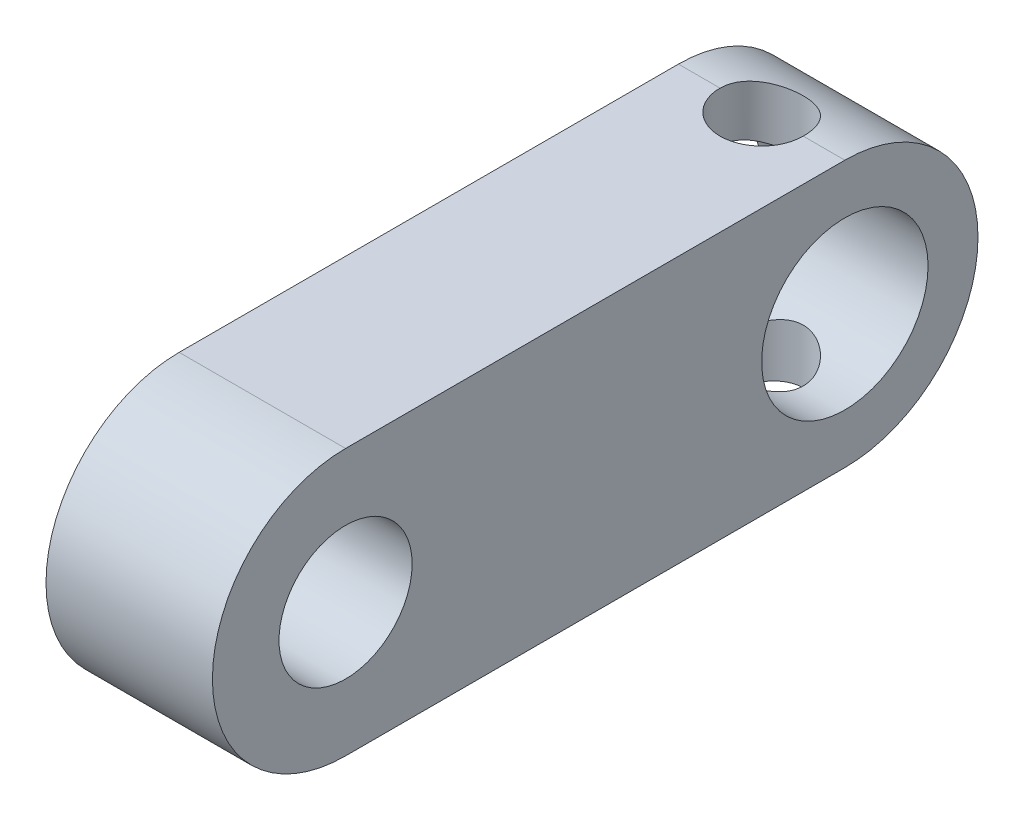
ISO-10303-21;
HEADER;
FILE_DESCRIPTION(('STEP AP214'),'2;1');
FILE_NAME('part.step','',(''),(''),'','','');
FILE_SCHEMA(('AUTOMOTIVE_DESIGN { 1 0 10303 214 1 1 1 1 }'));
ENDSEC;
DATA;
#1=APPLICATION_CONTEXT('core data for automotive mechanical design processes');
#2=APPLICATION_PROTOCOL_DEFINITION('international standard','automotive_design',2000,#1);
#3=PRODUCT_CONTEXT('',#1,'mechanical');
#4=PRODUCT('Part','Part','',(#3));
#5=PRODUCT_RELATED_PRODUCT_CATEGORY('part','',(#4));
#6=PRODUCT_DEFINITION_FORMATION('','',#4);
#7=PRODUCT_DEFINITION_CONTEXT('part definition',#1,'design');
#8=PRODUCT_DEFINITION('design','',#6,#7);
#9=PRODUCT_DEFINITION_SHAPE('','',#8);
#10=(LENGTH_UNIT() NAMED_UNIT(*) SI_UNIT(.MILLI.,.METRE.));
#11=(NAMED_UNIT(*) PLANE_ANGLE_UNIT() SI_UNIT($,.RADIAN.));
#12=(NAMED_UNIT(*) SI_UNIT($,.STERADIAN.) SOLID_ANGLE_UNIT());
#13=UNCERTAINTY_MEASURE_WITH_UNIT(LENGTH_MEASURE(1.E-05),#10,'distance_accuracy_value','');
#14=(GEOMETRIC_REPRESENTATION_CONTEXT(3) GLOBAL_UNCERTAINTY_ASSIGNED_CONTEXT((#13)) GLOBAL_UNIT_ASSIGNED_CONTEXT((#10,
#11,#12)) REPRESENTATION_CONTEXT('',''));
#15=CARTESIAN_POINT('',(0.,0.,0.));
#16=DIRECTION('',(0.,0.,1.));
#17=DIRECTION('',(1.,0.,0.));
#18=AXIS2_PLACEMENT_3D('',#15,#16,#17);
#19=CARTESIAN_POINT('',(10.,0.,15.));
#20=DIRECTION('',(1.,0.,0.));
#21=DIRECTION('',(0.,0.,-1.));
#22=AXIS2_PLACEMENT_3D('',#19,#20,#21);
#23=PLANE('',#22);
#24=CARTESIAN_POINT('',(10.,0.,-15.));
#25=DIRECTION('',(1.,0.,0.));
#26=DIRECTION('',(0.,0.,-1.));
#27=AXIS2_PLACEMENT_3D('',#24,#25,#26);
#28=CIRCLE('',#27,5.);
#29=CARTESIAN_POINT('',(10.,0.,-20.));
#30=VERTEX_POINT('',#29);
#31=EDGE_CURVE('E159',#30,#30,#28,.T.);
#32=ORIENTED_EDGE('',*,*,#31,.F.);
#33=EDGE_LOOP('',(#32));
#34=FACE_BOUND('',#33,.T.);
#35=CARTESIAN_POINT('',(10.,0.,15.));
#36=DIRECTION('',(1.,0.,0.));
#37=DIRECTION('',(0.,0.,-1.));
#38=AXIS2_PLACEMENT_3D('',#35,#36,#37);
#39=CIRCLE('',#38,8.);
#40=CARTESIAN_POINT('',(10.,8.,15.));
#41=VERTEX_POINT('',#40);
#42=CARTESIAN_POINT('',(10.,-8.,15.));
#43=VERTEX_POINT('',#42);
#44=EDGE_CURVE('E163',#41,#43,#39,.T.);
#45=ORIENTED_EDGE('',*,*,#44,.T.);
#46=DIRECTION('',(0.,0.,-1.));
#47=VECTOR('',#46,1.);
#48=CARTESIAN_POINT('',(10.,-8.,15.));
#49=LINE('',#48,#47);
#50=CARTESIAN_POINT('',(10.,-8.,-15.));
#51=VERTEX_POINT('',#50);
#52=EDGE_CURVE('E178',#43,#51,#49,.T.);
#53=ORIENTED_EDGE('',*,*,#52,.T.);
#54=CARTESIAN_POINT('',(10.,0.,-15.));
#55=DIRECTION('',(1.,0.,0.));
#56=DIRECTION('',(0.,0.,1.));
#57=AXIS2_PLACEMENT_3D('',#54,#55,#56);
#58=CIRCLE('',#57,8.);
#59=CARTESIAN_POINT('',(10.,8.,-15.));
#60=VERTEX_POINT('',#59);
#61=EDGE_CURVE('E108',#51,#60,#58,.T.);
#62=ORIENTED_EDGE('',*,*,#61,.T.);
#63=DIRECTION('',(0.,0.,1.));
#64=VECTOR('',#63,1.);
#65=CARTESIAN_POINT('',(10.,8.,-15.));
#66=LINE('',#65,#64);
#67=EDGE_CURVE('E182',#60,#41,#66,.T.);
#68=ORIENTED_EDGE('',*,*,#67,.T.);
#69=EDGE_LOOP('',(#45,#53,#62,#68));
#70=FACE_BOUND('',#69,.T.);
#71=CARTESIAN_POINT('',(10.,0.,15.));
#72=DIRECTION('',(1.,0.,0.));
#73=DIRECTION('',(0.,0.,-1.));
#74=AXIS2_PLACEMENT_3D('',#71,#72,#73);
#75=CIRCLE('',#74,4.);
#76=CARTESIAN_POINT('',(10.,0.,11.));
#77=VERTEX_POINT('',#76);
#78=EDGE_CURVE('E167',#77,#77,#75,.T.);
#79=ORIENTED_EDGE('',*,*,#78,.F.);
#80=EDGE_LOOP('',(#79));
#81=FACE_BOUND('',#80,.T.);
#82=ADVANCED_FACE('F34',(#34,#70,#81),#23,.T.);
#83=CARTESIAN_POINT('',(0.,0.,15.));
#84=DIRECTION('',(1.,0.,0.));
#85=DIRECTION('',(0.,0.,-1.));
#86=AXIS2_PLACEMENT_3D('',#83,#84,#85);
#87=PLANE('',#86);
#88=CARTESIAN_POINT('',(0.,0.,-15.));
#89=DIRECTION('',(1.,0.,0.));
#90=DIRECTION('',(0.,0.,-1.));
#91=AXIS2_PLACEMENT_3D('',#88,#89,#90);
#92=CIRCLE('',#91,5.);
#93=CARTESIAN_POINT('',(0.,0.,-20.));
#94=VERTEX_POINT('',#93);
#95=EDGE_CURVE('E169',#94,#94,#92,.T.);
#96=ORIENTED_EDGE('',*,*,#95,.T.);
#97=EDGE_LOOP('',(#96));
#98=FACE_BOUND('',#97,.T.);
#99=CARTESIAN_POINT('',(0.,0.,15.));
#100=DIRECTION('',(1.,0.,0.));
#101=DIRECTION('',(0.,0.,-1.));
#102=AXIS2_PLACEMENT_3D('',#99,#100,#101);
#103=CIRCLE('',#102,8.);
#104=CARTESIAN_POINT('',(0.,8.,15.));
#105=VERTEX_POINT('',#104);
#106=CARTESIAN_POINT('',(0.,-8.,15.));
#107=VERTEX_POINT('',#106);
#108=EDGE_CURVE('E175',#105,#107,#103,.T.);
#109=ORIENTED_EDGE('',*,*,#108,.F.);
#110=DIRECTION('',(0.,0.,1.));
#111=VECTOR('',#110,1.);
#112=CARTESIAN_POINT('',(0.,8.,-15.));
#113=LINE('',#112,#111);
#114=CARTESIAN_POINT('',(0.,8.,-15.));
#115=VERTEX_POINT('',#114);
#116=EDGE_CURVE('E179',#115,#105,#113,.T.);
#117=ORIENTED_EDGE('',*,*,#116,.F.);
#118=CARTESIAN_POINT('',(0.,0.,-15.));
#119=DIRECTION('',(1.,0.,0.));
#120=DIRECTION('',(0.,0.,1.));
#121=AXIS2_PLACEMENT_3D('',#118,#119,#120);
#122=CIRCLE('',#121,8.);
#123=CARTESIAN_POINT('',(0.,-8.,-15.));
#124=VERTEX_POINT('',#123);
#125=EDGE_CURVE('E189',#124,#115,#122,.T.);
#126=ORIENTED_EDGE('',*,*,#125,.F.);
#127=DIRECTION('',(0.,0.,-1.));
#128=VECTOR('',#127,1.);
#129=CARTESIAN_POINT('',(0.,-8.,15.));
#130=LINE('',#129,#128);
#131=EDGE_CURVE('E187',#107,#124,#130,.T.);
#132=ORIENTED_EDGE('',*,*,#131,.F.);
#133=EDGE_LOOP('',(#109,#117,#126,#132));
#134=FACE_BOUND('',#133,.T.);
#135=CARTESIAN_POINT('',(0.,0.,15.));
#136=DIRECTION('',(1.,0.,0.));
#137=DIRECTION('',(0.,0.,-1.));
#138=AXIS2_PLACEMENT_3D('',#135,#136,#137);
#139=CIRCLE('',#138,4.);
#140=CARTESIAN_POINT('',(0.,0.,11.));
#141=VERTEX_POINT('',#140);
#142=EDGE_CURVE('E95',#141,#141,#139,.T.);
#143=ORIENTED_EDGE('',*,*,#142,.T.);
#144=EDGE_LOOP('',(#143));
#145=FACE_BOUND('',#144,.T.);
#146=ADVANCED_FACE('F148',(#98,#134,#145),#87,.F.);
#147=CARTESIAN_POINT('',(10.,0.,15.));
#148=DIRECTION('',(-1.,0.,0.));
#149=DIRECTION('',(0.,0.,1.));
#150=AXIS2_PLACEMENT_3D('',#147,#148,#149);
#151=CYLINDRICAL_SURFACE('',#150,8.);
#152=ORIENTED_EDGE('',*,*,#108,.T.);
#153=DIRECTION('',(-1.,0.,0.));
#154=VECTOR('',#153,1.);
#155=CARTESIAN_POINT('',(10.,-8.,15.));
#156=LINE('',#155,#154);
#157=EDGE_CURVE('E11',#43,#107,#156,.T.);
#158=ORIENTED_EDGE('',*,*,#157,.F.);
#159=ORIENTED_EDGE('',*,*,#44,.F.);
#160=DIRECTION('',(-1.,0.,0.));
#161=VECTOR('',#160,1.);
#162=CARTESIAN_POINT('',(10.,8.,15.));
#163=LINE('',#162,#161);
#164=EDGE_CURVE('E184',#41,#105,#163,.T.);
#165=ORIENTED_EDGE('',*,*,#164,.T.);
#166=EDGE_LOOP('',(#152,#158,#159,#165));
#167=FACE_BOUND('',#166,.T.);
#168=ADVANCED_FACE('F36',(#167),#151,.T.);
#169=CARTESIAN_POINT('',(10.,-8.,15.));
#170=DIRECTION('',(0.,1.,0.));
#171=DIRECTION('',(0.,0.,1.));
#172=AXIS2_PLACEMENT_3D('',#169,#170,#171);
#173=PLANE('',#172);
#174=DIRECTION('',(-1.,0.,0.));
#175=VECTOR('',#174,1.);
#176=CARTESIAN_POINT('',(10.,-8.,-15.));
#177=LINE('',#176,#175);
#178=CARTESIAN_POINT('',(2.5,-8.,-15.));
#179=VERTEX_POINT('',#178);
#180=EDGE_CURVE('E102',#179,#124,#177,.T.);
#181=ORIENTED_EDGE('',*,*,#180,.F.);
#182=CARTESIAN_POINT('',(5.,-8.,-15.));
#183=DIRECTION('',(0.,1.,0.));
#184=DIRECTION('',(0.,0.,1.));
#185=AXIS2_PLACEMENT_3D('',#182,#183,#184);
#186=CIRCLE('',#185,2.5);
#187=CARTESIAN_POINT('',(7.5,-8.,-15.));
#188=VERTEX_POINT('',#187);
#189=EDGE_CURVE('E54',#179,#188,#186,.T.);
#190=ORIENTED_EDGE('',*,*,#189,.T.);
#191=EDGE_CURVE('E47',#51,#188,#177,.T.);
#192=ORIENTED_EDGE('',*,*,#191,.F.);
#193=ORIENTED_EDGE('',*,*,#52,.F.);
#194=ORIENTED_EDGE('',*,*,#157,.T.);
#195=ORIENTED_EDGE('',*,*,#131,.T.);
#196=EDGE_LOOP('',(#181,#190,#192,#193,#194,#195));
#197=FACE_BOUND('',#196,.T.);
#198=ADVANCED_FACE('F99',(#197),#173,.F.);
#199=CARTESIAN_POINT('',(10.,0.,-15.));
#200=DIRECTION('',(-1.,0.,0.));
#201=DIRECTION('',(0.,0.,1.));
#202=AXIS2_PLACEMENT_3D('',#199,#200,#201);
#203=CYLINDRICAL_SURFACE('',#202,8.);
#204=ORIENTED_EDGE('',*,*,#191,.T.);
#205=CARTESIAN_POINT('',(7.5,-8.,-15.));
#206=CARTESIAN_POINT('',(7.50000852601142,-8.00000828551832,-15.0685487375898));
#207=CARTESIAN_POINT('',(7.49718079886849,-7.9991191440238,-15.1370922432718));
#208=CARTESIAN_POINT('',(7.48591902577332,-7.99560760801551,-15.2736584627093));
#209=CARTESIAN_POINT('',(7.47748615607092,-7.99298557715254,-15.3416812827029));
#210=CARTESIAN_POINT('',(7.45510820487409,-7.98607844882144,-15.4765563962873));
#211=CARTESIAN_POINT('',(7.44117693843174,-7.98179751992037,-15.5434111883322));
#212=CARTESIAN_POINT('',(7.407939330678,-7.97169515696953,-15.6756340975135));
#213=CARTESIAN_POINT('',(7.38863287097266,-7.96587368898799,-15.7410021818694));
#214=CARTESIAN_POINT('',(7.32288580706765,-7.94632105573206,-15.9341595662137));
#215=CARTESIAN_POINT('',(7.26859025811381,-7.93049279279429,-16.05916451445));
#216=CARTESIAN_POINT('',(7.14078064523667,-7.89488403622453,-16.2982595609944));
#217=CARTESIAN_POINT('',(7.06725828053439,-7.87510183643384,-16.4123449158635));
#218=CARTESIAN_POINT('',(6.90069158717582,-7.83300504863903,-16.6299218583453));
#219=CARTESIAN_POINT('',(6.80716348112168,-7.81063554499908,-16.733033083694));
#220=CARTESIAN_POINT('',(6.60426855583545,-7.76620202095558,-16.9223918522217));
#221=CARTESIAN_POINT('',(6.49489797229332,-7.74413807452402,-17.00863537601));
#222=CARTESIAN_POINT('',(6.26010828060366,-7.70222242976765,-17.1638880685593));
#223=CARTESIAN_POINT('',(6.13435936927753,-7.68243887545914,-17.2324186688576));
#224=CARTESIAN_POINT('',(5.87240917132254,-7.64815537243522,-17.3471970391183));
#225=CARTESIAN_POINT('',(5.73621112420153,-7.6336537941174,-17.3934516831105));
#226=CARTESIAN_POINT('',(5.46154529903332,-7.61215225423914,-17.46096881224));
#227=CARTESIAN_POINT('',(5.32326926995984,-7.60493961151812,-17.4829417247826));
#228=CARTESIAN_POINT('',(5.04481675400958,-7.59820109395764,-17.5034911369138));
#229=CARTESIAN_POINT('',(4.9046407403388,-7.59867333904975,-17.5020733589136));
#230=CARTESIAN_POINT('',(4.63225031409493,-7.60706380493777,-17.4764364230841));
#231=CARTESIAN_POINT('',(4.49994023202209,-7.61468692290455,-17.4531208972351));
#232=CARTESIAN_POINT('',(4.24121423761495,-7.63604066973851,-17.3858157557635));
#233=CARTESIAN_POINT('',(4.11479888563526,-7.64977187794002,-17.3418241790561));
#234=CARTESIAN_POINT('',(3.86929545704556,-7.68202096695246,-17.2337772364259));
#235=CARTESIAN_POINT('',(3.75034152089718,-7.70060589200768,-17.1694379491668));
#236=CARTESIAN_POINT('',(3.52462331517965,-7.74043735773378,-17.0227194142873));
#237=CARTESIAN_POINT('',(3.417862092826,-7.76168456099361,-16.9403356719237));
#238=CARTESIAN_POINT('',(3.2144595778417,-7.80562852096723,-16.7554429544294));
#239=CARTESIAN_POINT('',(3.11849843121911,-7.82834727778431,-16.6521896856371));
#240=CARTESIAN_POINT('',(2.94507021527018,-7.87182761918423,-16.4307485553223));
#241=CARTESIAN_POINT('',(2.8676078750545,-7.89258870248028,-16.3125568866703));
#242=CARTESIAN_POINT('',(2.73290548098961,-7.93003694109363,-16.0632627059014));
#243=CARTESIAN_POINT('',(2.67583843937566,-7.94668888732126,-15.9320612621104));
#244=CARTESIAN_POINT('',(2.58485251978712,-7.97377122873637,-15.6613470319037));
#245=CARTESIAN_POINT('',(2.55089970375198,-7.98421074263934,-15.5218467593824));
#246=CARTESIAN_POINT('',(2.51942462400286,-7.9939469560764,-15.317524974591));
#247=CARTESIAN_POINT('',(2.51214152080421,-7.99621235684531,-15.2542135731288));
#248=CARTESIAN_POINT('',(2.50243337115814,-7.99923898062171,-15.1272789183425));
#249=CARTESIAN_POINT('',(2.5000010875289,-8.00000244442139,-15.0636562717724));
#250=CARTESIAN_POINT('',(2.49999999999988,-8.00000000000003,-15.));
#251=B_SPLINE_CURVE_WITH_KNOTS('',3,(#205,#206,#207,#208,#209,#210,#211,#212,#213,#214,#215,
#216,#217,#218,#219,#220,#221,#222,#223,#224,#225,#226,#227,#228,#229,#230,#231,#232,#233,#234,
#235,#236,#237,#238,#239,#240,#241,#242,#243,#244,#245,#246,#247,#248,#249,#250),.UNSPECIFIED.,
.F.,.F.,(4,2,2,2,2,2,2,2,2,2,2,2,2,2,2,2,2,2,2,2,2,2,4),(0.,0.205573209983622,0.411103293652345,
0.616120224939484,0.821141672284254,1.2306957185426,1.64042687401626,2.06149251997578,
2.482658379402,2.91423219989328,3.34567275763257,3.76412558310424,4.18247603777559,
4.58428767511505,4.9861374312315,5.39386205296842,5.80168835169556,6.22804332521313,
6.65450717746368,7.0845073262375,7.51387474652569,7.70501154874773,7.89586297038675),.UNSPECIFIED.);
#252=EDGE_CURVE('E90',#188,#179,#251,.T.);
#253=ORIENTED_EDGE('',*,*,#252,.T.);
#254=ORIENTED_EDGE('',*,*,#180,.T.);
#255=ORIENTED_EDGE('',*,*,#125,.T.);
#256=DIRECTION('',(-1.,0.,0.));
#257=VECTOR('',#256,1.);
#258=CARTESIAN_POINT('',(10.,8.,-15.));
#259=LINE('',#258,#257);
#260=CARTESIAN_POINT('',(2.5,8.,-15.));
#261=VERTEX_POINT('',#260);
#262=EDGE_CURVE('E193',#261,#115,#259,.T.);
#263=ORIENTED_EDGE('',*,*,#262,.F.);
#264=CARTESIAN_POINT('',(2.5,8.,-15.));
#265=CARTESIAN_POINT('',(2.49999147398858,8.00000828551833,-15.0685487375898));
#266=CARTESIAN_POINT('',(2.50281920113152,7.9991191440238,-15.1370922432718));
#267=CARTESIAN_POINT('',(2.51408097422669,7.99560760801552,-15.2736584627093));
#268=CARTESIAN_POINT('',(2.52251384392909,7.99298557715255,-15.3416812827029));
#269=CARTESIAN_POINT('',(2.54489179512592,7.98607844882145,-15.4765563962873));
#270=CARTESIAN_POINT('',(2.55882306156826,7.98179751992038,-15.5434111883322));
#271=CARTESIAN_POINT('',(2.59206066932201,7.97169515696954,-15.6756340975135));
#272=CARTESIAN_POINT('',(2.61136712902735,7.965873688988,-15.7410021818694));
#273=CARTESIAN_POINT('',(2.67711419293235,7.94632105573207,-15.9341595662137));
#274=CARTESIAN_POINT('',(2.7314097418862,7.9304927927943,-16.05916451445));
#275=CARTESIAN_POINT('',(2.85921935476334,7.89488403622453,-16.2982595609944));
#276=CARTESIAN_POINT('',(2.93274171946562,7.87510183643385,-16.4123449158635));
#277=CARTESIAN_POINT('',(3.09930841282419,7.83300504863904,-16.6299218583453));
#278=CARTESIAN_POINT('',(3.19283651887833,7.81063554499909,-16.733033083694));
#279=CARTESIAN_POINT('',(3.39573144416455,7.76620202095559,-16.9223918522217));
#280=CARTESIAN_POINT('',(3.50510202770668,7.74413807452403,-17.00863537601));
#281=CARTESIAN_POINT('',(3.73989171939634,7.70222242976765,-17.1638880685593));
#282=CARTESIAN_POINT('',(3.86564063072247,7.68243887545915,-17.2324186688576));
#283=CARTESIAN_POINT('',(4.12759082867746,7.64815537243523,-17.3471970391183));
#284=CARTESIAN_POINT('',(4.26378887579847,7.6336537941174,-17.3934516831105));
#285=CARTESIAN_POINT('',(4.53845470096668,7.61215225423915,-17.46096881224));
#286=CARTESIAN_POINT('',(4.67673073004017,7.60493961151813,-17.4829417247826));
#287=CARTESIAN_POINT('',(4.95518324599043,7.59820109395765,-17.5034911369138));
#288=CARTESIAN_POINT('',(5.09535925966121,7.59867333904976,-17.5020733589136));
#289=CARTESIAN_POINT('',(5.36774968590507,7.60706380493778,-17.4764364230841));
#290=CARTESIAN_POINT('',(5.50005976797791,7.61468692290455,-17.4531208972351));
#291=CARTESIAN_POINT('',(5.75878576238505,7.63604066973851,-17.3858157557635));
#292=CARTESIAN_POINT('',(5.88520111436474,7.64977187794003,-17.3418241790561));
#293=CARTESIAN_POINT('',(6.13070454295445,7.68202096695247,-17.2337772364259));
#294=CARTESIAN_POINT('',(6.24965847910282,7.70060589200768,-17.1694379491668));
#295=CARTESIAN_POINT('',(6.47537668482035,7.74043735773379,-17.0227194142873));
#296=CARTESIAN_POINT('',(6.582137907174,7.76168456099362,-16.9403356719237));
#297=CARTESIAN_POINT('',(6.78554042215831,7.80562852096724,-16.7554429544294));
#298=CARTESIAN_POINT('',(6.88150156878089,7.82834727778432,-16.6521896856371));
#299=CARTESIAN_POINT('',(7.05492978472983,7.87182761918424,-16.4307485553223));
#300=CARTESIAN_POINT('',(7.13239212494551,7.89258870248029,-16.3125568866703));
#301=CARTESIAN_POINT('',(7.26709451901039,7.93003694109364,-16.0632627059014));
#302=CARTESIAN_POINT('',(7.32416156062435,7.94668888732127,-15.9320612621104));
#303=CARTESIAN_POINT('',(7.41514748021288,7.97377122873638,-15.6613470319037));
#304=CARTESIAN_POINT('',(7.44910029624802,7.98421074263934,-15.5218467593824));
#305=CARTESIAN_POINT('',(7.48057537599715,7.9939469560764,-15.317524974591));
#306=CARTESIAN_POINT('',(7.48785847919579,7.99621235684532,-15.2542135731288));
#307=CARTESIAN_POINT('',(7.49756662884187,7.99923898062172,-15.1272789183425));
#308=CARTESIAN_POINT('',(7.4999989124711,8.00000244442139,-15.0636562717724));
#309=CARTESIAN_POINT('',(7.50000000000012,8.00000000000004,-15.));
#310=B_SPLINE_CURVE_WITH_KNOTS('',3,(#264,#265,#266,#267,#268,#269,#270,#271,#272,#273,#274,
#275,#276,#277,#278,#279,#280,#281,#282,#283,#284,#285,#286,#287,#288,#289,#290,#291,#292,#293,
#294,#295,#296,#297,#298,#299,#300,#301,#302,#303,#304,#305,#306,#307,#308,#309),.UNSPECIFIED.,
.F.,.F.,(4,2,2,2,2,2,2,2,2,2,2,2,2,2,2,2,2,2,2,2,2,2,4),(0.,0.205573209983622,0.411103293652343,
0.616120224939479,0.821141672284252,1.2306957185426,1.64042687401625,2.06149251997578,
2.482658379402,2.91423219989328,3.34567275763257,3.76412558310424,4.18247603777559,
4.58428767511505,4.9861374312315,5.39386205296841,5.80168835169556,6.22804332521313,
6.65450717746368,7.08450732623749,7.51387474652568,7.70501154874773,7.89586297038675),.UNSPECIFIED.);
#311=CARTESIAN_POINT('',(7.5,8.,-15.));
#312=VERTEX_POINT('',#311);
#313=EDGE_CURVE('E61',#261,#312,#310,.T.);
#314=ORIENTED_EDGE('',*,*,#313,.T.);
#315=EDGE_CURVE('E110',#60,#312,#259,.T.);
#316=ORIENTED_EDGE('',*,*,#315,.F.);
#317=ORIENTED_EDGE('',*,*,#61,.F.);
#318=EDGE_LOOP('',(#204,#253,#254,#255,#263,#314,#316,#317));
#319=FACE_BOUND('',#318,.T.);
#320=ADVANCED_FACE('F106',(#319),#203,.T.);
#321=CARTESIAN_POINT('',(10.,8.,-15.));
#322=DIRECTION('',(0.,-1.,0.));
#323=DIRECTION('',(0.,0.,-1.));
#324=AXIS2_PLACEMENT_3D('',#321,#322,#323);
#325=PLANE('',#324);
#326=ORIENTED_EDGE('',*,*,#315,.T.);
#327=CARTESIAN_POINT('',(5.,8.,-15.));
#328=DIRECTION('',(0.,1.,0.));
#329=DIRECTION('',(0.,0.,1.));
#330=AXIS2_PLACEMENT_3D('',#327,#328,#329);
#331=CIRCLE('',#330,2.5);
#332=EDGE_CURVE('E104',#261,#312,#331,.T.);
#333=ORIENTED_EDGE('',*,*,#332,.F.);
#334=ORIENTED_EDGE('',*,*,#262,.T.);
#335=ORIENTED_EDGE('',*,*,#116,.T.);
#336=ORIENTED_EDGE('',*,*,#164,.F.);
#337=ORIENTED_EDGE('',*,*,#67,.F.);
#338=EDGE_LOOP('',(#326,#333,#334,#335,#336,#337));
#339=FACE_BOUND('',#338,.T.);
#340=ADVANCED_FACE('F141',(#339),#325,.F.);
#341=CARTESIAN_POINT('',(10.,0.,-15.));
#342=DIRECTION('',(-1.,0.,0.));
#343=DIRECTION('',(0.,0.,1.));
#344=AXIS2_PLACEMENT_3D('',#341,#342,#343);
#345=CYLINDRICAL_SURFACE('',#344,5.);
#346=CARTESIAN_POINT('',(5.,-4.33012701892219,-12.5));
#347=CARTESIAN_POINT('',(5.13026650687649,-4.33013982272991,-12.5000105156357));
#348=CARTESIAN_POINT('',(5.26070272067625,-4.33609541965583,-12.5102504548683));
#349=CARTESIAN_POINT('',(5.51756897152923,-4.35905877051907,-12.5506915927506));
#350=CARTESIAN_POINT('',(5.64399000405729,-4.37608974726022,-12.5809347363046));
#351=CARTESIAN_POINT('',(5.88862894556107,-4.41873376871658,-12.6597502300243));
#352=CARTESIAN_POINT('',(6.00688657356221,-4.44430111338921,-12.7082251463004));
#353=CARTESIAN_POINT('',(6.23356056309455,-4.50106659111455,-12.8218311594359));
#354=CARTESIAN_POINT('',(6.34197639179579,-4.53226502875883,-12.8869631573733));
#355=CARTESIAN_POINT('',(6.55576430391693,-4.5999217352485,-13.0383336568275));
#356=CARTESIAN_POINT('',(6.66014783448977,-4.63660159331577,-13.1258699118308));
#357=CARTESIAN_POINT('',(6.8535209757132,-4.70929956727452,-13.3168654787725));
#358=CARTESIAN_POINT('',(6.94250290775495,-4.74531734512768,-13.4203326849395));
#359=CARTESIAN_POINT('',(7.10841787648564,-4.81553692452134,-13.6487760921092));
#360=CARTESIAN_POINT('',(7.18413441927914,-4.84945266064072,-13.7747320276411));
#361=CARTESIAN_POINT('',(7.31285213348386,-4.90876890230193,-14.0396074333289));
#362=CARTESIAN_POINT('',(7.3658676404385,-4.93417477954534,-14.17851865461));
#363=CARTESIAN_POINT('',(7.44376165316397,-4.97201153115069,-14.4548876402265));
#364=CARTESIAN_POINT('',(7.47037381586513,-4.98523700553425,-14.591745523789));
#365=CARTESIAN_POINT('',(7.50041529671129,-5.00018959613972,-14.8685734282443));
#366=CARTESIAN_POINT('',(7.50385864199536,-5.00192366961168,-15.0085415146065));
#367=CARTESIAN_POINT('',(7.48813331506858,-4.99407454791405,-15.274581311062));
#368=CARTESIAN_POINT('',(7.47090496119546,-4.98546239730476,-15.4008029979427));
#369=CARTESIAN_POINT('',(7.41779789023985,-4.95935613149293,-15.6482844297951));
#370=CARTESIAN_POINT('',(7.38191777755985,-4.94186135165964,-15.7695438027346));
#371=CARTESIAN_POINT('',(7.29229358477506,-4.89928958219156,-16.0057734789241));
#372=CARTESIAN_POINT('',(7.23830921706972,-4.87411103823003,-16.120633558788));
#373=CARTESIAN_POINT('',(7.11434145949638,-4.81844114966712,-16.3399420037833));
#374=CARTESIAN_POINT('',(7.04435234174416,-4.78794790393708,-16.4443866220966));
#375=CARTESIAN_POINT('',(6.88276162116743,-4.72110985998074,-16.6504341522455));
#376=CARTESIAN_POINT('',(6.78974242918497,-4.68448439995438,-16.7508351875734));
#377=CARTESIAN_POINT('',(6.58852568767457,-4.61135851467028,-16.9352609257445));
#378=CARTESIAN_POINT('',(6.48031656931485,-4.57485820664072,-17.0192730289356));
#379=CARTESIAN_POINT('',(6.24337951893978,-4.50360390231211,-17.1737633366055));
#380=CARTESIAN_POINT('',(6.11378494236448,-4.46910799976768,-17.2430432874451));
#381=CARTESIAN_POINT('',(5.84265582160251,-4.40938625696439,-17.3582977825031));
#382=CARTESIAN_POINT('',(5.7011339174561,-4.38415075115168,-17.4042966455272));
#383=CARTESIAN_POINT('',(5.42196372179303,-4.34861589542586,-17.4679505275626));
#384=CARTESIAN_POINT('',(5.28489720239113,-4.33729139621241,-17.4875628052999));
#385=CARTESIAN_POINT('',(5.00899664620864,-4.32794798404023,-17.5037923665286));
#386=CARTESIAN_POINT('',(4.87016392720051,-4.32991967223279,-17.5004258932876));
#387=CARTESIAN_POINT('',(4.61086520355321,-4.34585841351462,-17.4725901083599));
#388=CARTESIAN_POINT('',(4.49005137223027,-4.35848968766635,-17.4504695417812));
#389=CARTESIAN_POINT('',(4.25408053432252,-4.39235053878352,-17.3892407115811));
#390=CARTESIAN_POINT('',(4.13892537313315,-4.41358290012584,-17.3501269465591));
#391=CARTESIAN_POINT('',(3.91147167274361,-4.46340555199141,-17.2541189715122));
#392=CARTESIAN_POINT('',(3.79955245786744,-4.49229108107657,-17.1964851592316));
#393=CARTESIAN_POINT('',(3.5863268211512,-4.55390298743125,-17.0657176600397));
#394=CARTESIAN_POINT('',(3.48502589121187,-4.58663133387872,-16.9925760108312));
#395=CARTESIAN_POINT('',(3.28255308119668,-4.65719996140836,-16.8220929179964));
#396=CARTESIAN_POINT('',(3.18300712322778,-4.69516457885707,-16.7228631807844));
#397=CARTESIAN_POINT('',(3.00146940499409,-4.76835587444746,-16.5085112384988));
#398=CARTESIAN_POINT('',(2.91948357434145,-4.80358162519329,-16.3933836866499));
#399=CARTESIAN_POINT('',(2.77356568520912,-4.86853404227334,-16.1463384063851));
#400=CARTESIAN_POINT('',(2.71016720479154,-4.89809104179855,-16.0140577438906));
#401=CARTESIAN_POINT('',(2.60715524003799,-4.9470838739847,-15.7388059116473));
#402=CARTESIAN_POINT('',(2.56752087039488,-4.96652859191746,-15.5958442536471));
#403=CARTESIAN_POINT('',(2.51657859064358,-4.99168770453968,-15.3174492056747));
#404=CARTESIAN_POINT('',(2.50300531416966,-4.99849819767837,-15.1825286090854));
#405=CARTESIAN_POINT('',(2.49789183250541,-5.00105325940467,-14.9121850356626));
#406=CARTESIAN_POINT('',(2.50634391433892,-4.99680170177041,-14.776762251273));
#407=CARTESIAN_POINT('',(2.54354103039551,-4.97834922085636,-14.5186550173289));
#408=CARTESIAN_POINT('',(2.57091217163632,-4.96482236636806,-14.3957191986782));
#409=CARTESIAN_POINT('',(2.64331744975833,-4.92980234191731,-14.1563851263356));
#410=CARTESIAN_POINT('',(2.68835411963364,-4.90830802955517,-14.0399878129128));
#411=CARTESIAN_POINT('',(2.79681781873926,-4.85814826741488,-13.8114414580041));
#412=CARTESIAN_POINT('',(2.86094902468985,-4.82921542506802,-13.6996870428464));
#413=CARTESIAN_POINT('',(3.0048941101476,-4.76720333344985,-13.4880634959147));
#414=CARTESIAN_POINT('',(3.08471519262687,-4.73412218229104,-13.388199856946));
#415=CARTESIAN_POINT('',(3.26699579444937,-4.66321523550925,-13.1927145767563));
#416=CARTESIAN_POINT('',(3.37091772600074,-4.62524489658366,-13.09850417651));
#417=CARTESIAN_POINT('',(3.59361528538223,-4.55157698284941,-12.928343395075));
#418=CARTESIAN_POINT('',(3.71240391419923,-4.51588143910584,-12.8524091684846));
#419=CARTESIAN_POINT('',(3.96663611766426,-4.44998982823926,-12.7189160660397));
#420=CARTESIAN_POINT('',(4.10248738842461,-4.42000320346984,-12.6620137202255));
#421=CARTESIAN_POINT('',(4.31322264951978,-4.38370272660093,-12.5950508811954));
#422=CARTESIAN_POINT('',(4.38455977569761,-4.37305486646054,-12.5758041731601));
#423=CARTESIAN_POINT('',(4.52904069684934,-4.35507574170934,-12.5436491274421));
#424=CARTESIAN_POINT('',(4.60218319095442,-4.34774215854233,-12.5307363582082));
#425=CARTESIAN_POINT('',(4.72950098654694,-4.3382377954292,-12.5140883379858));
#426=CARTESIAN_POINT('',(4.78341632151221,-4.33520487024791,-12.508811350208));
#427=CARTESIAN_POINT('',(4.89154461631041,-4.33114674911322,-12.5017648745607));
#428=CARTESIAN_POINT('',(4.94575759581056,-4.33012168747261,-12.4999956213353));
#429=CARTESIAN_POINT('',(5.,-4.33012701892219,-12.5));
#430=B_SPLINE_CURVE_WITH_KNOTS('',3,(#346,#347,#348,#349,#350,#351,#352,#353,#354,#355,#356,
#357,#358,#359,#360,#361,#362,#363,#364,#365,#366,#367,#368,#369,#370,#371,#372,#373,#374,#375,
#376,#377,#378,#379,#380,#381,#382,#383,#384,#385,#386,#387,#388,#389,#390,#391,#392,#393,#394,
#395,#396,#397,#398,#399,#400,#401,#402,#403,#404,#405,#406,#407,#408,#409,#410,#411,#412,#413,
#414,#415,#416,#417,#418,#419,#420,#421,#422,#423,#424,#425,#426,#427,#428,#429),.UNSPECIFIED.,
.T.,.F.,(4,2,2,2,2,2,2,2,2,2,2,2,2,2,2,2,2,2,2,2,2,2,2,2,2,2,2,2,2,2,2,2,2,2,2,2,2,2,2,2,2,4),
(0.,0.390580306486789,0.781982232062012,1.17132148982692,1.56068181366371,1.98215578129642,
2.40383927716011,2.85394730601992,3.30377067414811,3.72158712424921,4.13915059220183,
4.52040243716429,4.90168281298721,5.2882383683295,5.67493248380763,6.0981797864731,
6.5217512061988,6.97222104328704,7.42221935534346,7.83655727140613,8.25060232976016,
8.61935458565147,8.98822631095241,9.37418241020302,9.76033715555202,10.1951685895662,
10.6301466245059,11.076604535375,11.5226694952701,11.927806759788,12.3328021699001,
12.7111106218382,13.0894733378512,13.4840187680376,13.8787457525688,14.3127560463025,
14.7471485711797,15.195268726016,15.4189244153949,15.6424233996907,15.8050484542806,
15.9676843870379),.UNSPECIFIED.);
#431=CARTESIAN_POINT('',(5.,-4.33012701892219,-12.5));
#432=VERTEX_POINT('',#431);
#433=EDGE_CURVE('E38',#432,#432,#430,.T.);
#434=ORIENTED_EDGE('',*,*,#433,.F.);
#435=EDGE_LOOP('',(#434));
#436=FACE_BOUND('',#435,.T.);
#437=CARTESIAN_POINT('',(5.,4.3301270189222,-12.5));
#438=CARTESIAN_POINT('',(4.86973349312351,4.33013982272992,-12.5000105156357));
#439=CARTESIAN_POINT('',(4.73929727932375,4.33609541965583,-12.5102504548683));
#440=CARTESIAN_POINT('',(4.48243102847077,4.35905877051908,-12.5506915927506));
#441=CARTESIAN_POINT('',(4.35600999594271,4.37608974726023,-12.5809347363046));
#442=CARTESIAN_POINT('',(4.11137105443894,4.41873376871659,-12.6597502300243));
#443=CARTESIAN_POINT('',(3.99311342643779,4.44430111338921,-12.7082251463004));
#444=CARTESIAN_POINT('',(3.76643943690546,4.50106659111456,-12.8218311594359));
#445=CARTESIAN_POINT('',(3.65802360820421,4.53226502875883,-12.8869631573733));
#446=CARTESIAN_POINT('',(3.44423569608308,4.59992173524851,-13.0383336568275));
#447=CARTESIAN_POINT('',(3.33985216551024,4.63660159331578,-13.1258699118308));
#448=CARTESIAN_POINT('',(3.1464790242868,4.70929956727453,-13.3168654787725));
#449=CARTESIAN_POINT('',(3.05749709224505,4.74531734512768,-13.4203326849395));
#450=CARTESIAN_POINT('',(2.89158212351437,4.81553692452135,-13.6487760921092));
#451=CARTESIAN_POINT('',(2.81586558072086,4.84945266064072,-13.7747320276411));
#452=CARTESIAN_POINT('',(2.68714786651614,4.90876890230194,-14.0396074333289));
#453=CARTESIAN_POINT('',(2.63413235956151,4.93417477954535,-14.17851865461));
#454=CARTESIAN_POINT('',(2.55623834683603,4.9720115311507,-14.4548876402265));
#455=CARTESIAN_POINT('',(2.52962618413488,4.98523700553426,-14.591745523789));
#456=CARTESIAN_POINT('',(2.49958470328871,5.00018959613973,-14.8685734282443));
#457=CARTESIAN_POINT('',(2.49614135800465,5.00192366961168,-15.0085415146065));
#458=CARTESIAN_POINT('',(2.51186668493143,4.99407454791406,-15.274581311062));
#459=CARTESIAN_POINT('',(2.52909503880455,4.98546239730476,-15.4008029979427));
#460=CARTESIAN_POINT('',(2.58220210976016,4.95935613149294,-15.6482844297951));
#461=CARTESIAN_POINT('',(2.61808222244016,4.94186135165964,-15.7695438027346));
#462=CARTESIAN_POINT('',(2.70770641522494,4.89928958219157,-16.0057734789241));
#463=CARTESIAN_POINT('',(2.76169078293028,4.87411103823004,-16.120633558788));
#464=CARTESIAN_POINT('',(2.88565854050363,4.81844114966713,-16.3399420037833));
#465=CARTESIAN_POINT('',(2.95564765825585,4.78794790393709,-16.4443866220966));
#466=CARTESIAN_POINT('',(3.11723837883257,4.72110985998075,-16.6504341522455));
#467=CARTESIAN_POINT('',(3.21025757081504,4.68448439995439,-16.7508351875734));
#468=CARTESIAN_POINT('',(3.41147431232543,4.61135851467029,-16.9352609257445));
#469=CARTESIAN_POINT('',(3.51968343068516,4.57485820664072,-17.0192730289356));
#470=CARTESIAN_POINT('',(3.75662048106022,4.50360390231212,-17.1737633366055));
#471=CARTESIAN_POINT('',(3.88621505763553,4.46910799976769,-17.2430432874451));
#472=CARTESIAN_POINT('',(4.1573441783975,4.4093862569644,-17.3582977825031));
#473=CARTESIAN_POINT('',(4.29886608254391,4.38415075115169,-17.4042966455272));
#474=CARTESIAN_POINT('',(4.57803627820698,4.34861589542586,-17.4679505275626));
#475=CARTESIAN_POINT('',(4.71510279760887,4.33729139621241,-17.4875628052999));
#476=CARTESIAN_POINT('',(4.99100335379136,4.32794798404024,-17.5037923665286));
#477=CARTESIAN_POINT('',(5.1298360727995,4.32991967223279,-17.5004258932876));
#478=CARTESIAN_POINT('',(5.3891347964468,4.34585841351463,-17.4725901083599));
#479=CARTESIAN_POINT('',(5.50994862776973,4.35848968766636,-17.4504695417812));
#480=CARTESIAN_POINT('',(5.74591946567749,4.39235053878353,-17.3892407115811));
#481=CARTESIAN_POINT('',(5.86107462686686,4.41358290012585,-17.3501269465591));
#482=CARTESIAN_POINT('',(6.0885283272564,4.46340555199142,-17.2541189715122));
#483=CARTESIAN_POINT('',(6.20044754213257,4.49229108107658,-17.1964851592316));
#484=CARTESIAN_POINT('',(6.41367317884881,4.55390298743126,-17.0657176600397));
#485=CARTESIAN_POINT('',(6.51497410878814,4.58663133387873,-16.9925760108312));
#486=CARTESIAN_POINT('',(6.71744691880332,4.65719996140836,-16.8220929179964));
#487=CARTESIAN_POINT('',(6.81699287677222,4.69516457885708,-16.7228631807844));
#488=CARTESIAN_POINT('',(6.99853059500592,4.76835587444747,-16.5085112384988));
#489=CARTESIAN_POINT('',(7.08051642565855,4.8035816251933,-16.3933836866499));
#490=CARTESIAN_POINT('',(7.22643431479089,4.86853404227335,-16.1463384063851));
#491=CARTESIAN_POINT('',(7.28983279520846,4.89809104179855,-16.0140577438906));
#492=CARTESIAN_POINT('',(7.39284475996202,4.94708387398471,-15.7388059116473));
#493=CARTESIAN_POINT('',(7.43247912960512,4.96652859191746,-15.5958442536471));
#494=CARTESIAN_POINT('',(7.48342140935642,4.99168770453968,-15.3174492056747));
#495=CARTESIAN_POINT('',(7.49699468583035,4.99849819767838,-15.1825286090854));
#496=CARTESIAN_POINT('',(7.50210816749459,5.00105325940467,-14.9121850356626));
#497=CARTESIAN_POINT('',(7.49365608566109,4.99680170177042,-14.776762251273));
#498=CARTESIAN_POINT('',(7.4564589696045,4.97834922085637,-14.5186550173289));
#499=CARTESIAN_POINT('',(7.42908782836369,4.96482236636807,-14.3957191986782));
#500=CARTESIAN_POINT('',(7.35668255024167,4.92980234191731,-14.1563851263355));
#501=CARTESIAN_POINT('',(7.31164588036637,4.90830802955518,-14.0399878129128));
#502=CARTESIAN_POINT('',(7.20318218126074,4.85814826741488,-13.8114414580041));
#503=CARTESIAN_POINT('',(7.13905097531016,4.82921542506803,-13.6996870428464));
#504=CARTESIAN_POINT('',(6.99510588985241,4.76720333344986,-13.4880634959147));
#505=CARTESIAN_POINT('',(6.91528480737313,4.73412218229105,-13.388199856946));
#506=CARTESIAN_POINT('',(6.73300420555064,4.66321523550925,-13.1927145767563));
#507=CARTESIAN_POINT('',(6.62908227399927,4.62524489658367,-13.09850417651));
#508=CARTESIAN_POINT('',(6.40638471461777,4.55157698284941,-12.928343395075));
#509=CARTESIAN_POINT('',(6.28759608580077,4.51588143910585,-12.8524091684846));
#510=CARTESIAN_POINT('',(6.03336388233574,4.44998982823926,-12.7189160660397));
#511=CARTESIAN_POINT('',(5.8975126115754,4.42000320346984,-12.6620137202255));
#512=CARTESIAN_POINT('',(5.68677735048023,4.38370272660094,-12.5950508811954));
#513=CARTESIAN_POINT('',(5.61544022430239,4.37305486646054,-12.5758041731601));
#514=CARTESIAN_POINT('',(5.47095930315067,4.35507574170935,-12.5436491274421));
#515=CARTESIAN_POINT('',(5.39781680904558,4.34774215854234,-12.5307363582082));
#516=CARTESIAN_POINT('',(5.27049901345306,4.33823779542921,-12.5140883379858));
#517=CARTESIAN_POINT('',(5.21658367848779,4.33520487024791,-12.508811350208));
#518=CARTESIAN_POINT('',(5.10845538368959,4.33114674911323,-12.5017648745607));
#519=CARTESIAN_POINT('',(5.05424240418945,4.33012168747261,-12.4999956213353));
#520=CARTESIAN_POINT('',(5.,4.3301270189222,-12.5));
#521=B_SPLINE_CURVE_WITH_KNOTS('',3,(#437,#438,#439,#440,#441,#442,#443,#444,#445,#446,#447,
#448,#449,#450,#451,#452,#453,#454,#455,#456,#457,#458,#459,#460,#461,#462,#463,#464,#465,#466,
#467,#468,#469,#470,#471,#472,#473,#474,#475,#476,#477,#478,#479,#480,#481,#482,#483,#484,#485,
#486,#487,#488,#489,#490,#491,#492,#493,#494,#495,#496,#497,#498,#499,#500,#501,#502,#503,#504,
#505,#506,#507,#508,#509,#510,#511,#512,#513,#514,#515,#516,#517,#518,#519,#520),.UNSPECIFIED.,
.T.,.F.,(4,2,2,2,2,2,2,2,2,2,2,2,2,2,2,2,2,2,2,2,2,2,2,2,2,2,2,2,2,2,2,2,2,2,2,2,2,2,2,2,2,4),
(0.,0.390580306486789,0.781982232062012,1.17132148982692,1.56068181366371,1.98215578129642,
2.40383927716011,2.85394730601992,3.30377067414811,3.72158712424921,4.13915059220183,
4.52040243716429,4.90168281298721,5.2882383683295,5.67493248380763,6.0981797864731,
6.5217512061988,6.97222104328704,7.42221935534346,7.83655727140613,8.25060232976016,
8.61935458565147,8.98822631095241,9.37418241020302,9.76033715555202,10.1951685895662,
10.6301466245059,11.076604535375,11.5226694952701,11.927806759788,12.3328021699001,
12.7111106218381,13.0894733378512,13.4840187680376,13.8787457525688,14.3127560463025,
14.7471485711797,15.195268726016,15.4189244153949,15.6424233996907,15.8050484542806,
15.9676843870379),.UNSPECIFIED.);
#522=CARTESIAN_POINT('',(5.,4.3301270189222,-12.5));
#523=VERTEX_POINT('',#522);
#524=EDGE_CURVE('E103',#523,#523,#521,.T.);
#525=ORIENTED_EDGE('',*,*,#524,.F.);
#526=EDGE_LOOP('',(#525));
#527=FACE_BOUND('',#526,.T.);
#528=ORIENTED_EDGE('',*,*,#31,.T.);
#529=EDGE_LOOP('',(#528));
#530=FACE_BOUND('',#529,.T.);
#531=ORIENTED_EDGE('',*,*,#95,.F.);
#532=EDGE_LOOP('',(#531));
#533=FACE_BOUND('',#532,.T.);
#534=ADVANCED_FACE('F116',(#436,#527,#530,#533),#345,.F.);
#535=CARTESIAN_POINT('',(10.,0.,15.));
#536=DIRECTION('',(-1.,0.,0.));
#537=DIRECTION('',(0.,0.,1.));
#538=AXIS2_PLACEMENT_3D('',#535,#536,#537);
#539=CYLINDRICAL_SURFACE('',#538,4.);
#540=ORIENTED_EDGE('',*,*,#78,.T.);
#541=EDGE_LOOP('',(#540));
#542=FACE_BOUND('',#541,.T.);
#543=ORIENTED_EDGE('',*,*,#142,.F.);
#544=EDGE_LOOP('',(#543));
#545=FACE_BOUND('',#544,.T.);
#546=ADVANCED_FACE('F124',(#542,#545),#539,.F.);
#547=CARTESIAN_POINT('',(5.,-8.,-15.));
#548=DIRECTION('',(0.,1.,0.));
#549=DIRECTION('',(0.,0.,1.));
#550=AXIS2_PLACEMENT_3D('',#547,#548,#549);
#551=CYLINDRICAL_SURFACE('',#550,2.5);
#552=ORIENTED_EDGE('',*,*,#524,.T.);
#553=EDGE_LOOP('',(#552));
#554=FACE_BOUND('',#553,.T.);
#555=ORIENTED_EDGE('',*,*,#332,.T.);
#556=ORIENTED_EDGE('',*,*,#313,.F.);
#557=EDGE_LOOP('',(#555,#556));
#558=FACE_BOUND('',#557,.T.);
#559=ADVANCED_FACE('F122',(#554,#558),#551,.F.);
#560=ORIENTED_EDGE('',*,*,#433,.T.);
#561=EDGE_LOOP('',(#560));
#562=FACE_BOUND('',#561,.T.);
#563=ORIENTED_EDGE('',*,*,#189,.F.);
#564=ORIENTED_EDGE('',*,*,#252,.F.);
#565=EDGE_LOOP('',(#563,#564));
#566=FACE_BOUND('',#565,.T.);
#567=ADVANCED_FACE('F91',(#562,#566),#551,.F.);
#568=CLOSED_SHELL('',(#82,#146,#168,#198,#320,#340,#534,#546,#559,#567));
#569=MANIFOLD_SOLID_BREP('B2',#568);
#570=ADVANCED_BREP_SHAPE_REPRESENTATION('',(#18,#569),#14);
#571=SHAPE_DEFINITION_REPRESENTATION(#9,#570);
ENDSEC;
END-ISO-10303-21;
